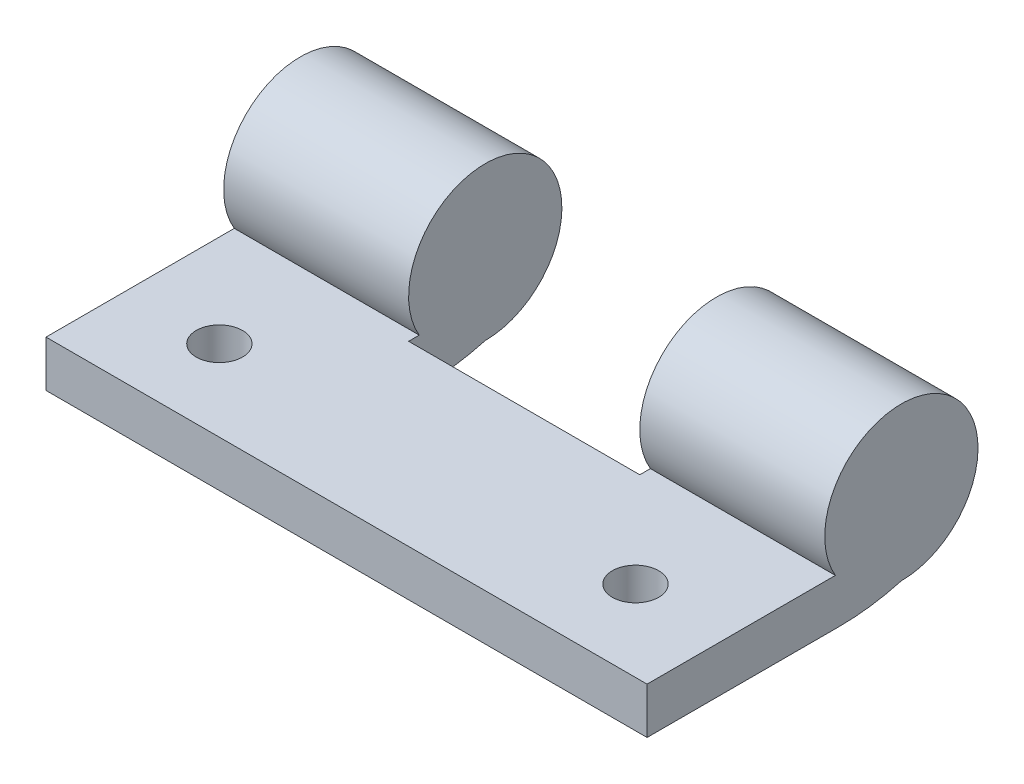
ISO-10303-21;
HEADER;
FILE_DESCRIPTION(('STEP AP214'),'2;1');
FILE_NAME('part.step','',(''),(''),'','','');
FILE_SCHEMA(('AUTOMOTIVE_DESIGN { 1 0 10303 214 1 1 1 1 }'));
ENDSEC;
DATA;
#1=APPLICATION_CONTEXT('core data for automotive mechanical design processes');
#2=APPLICATION_PROTOCOL_DEFINITION('international standard','automotive_design',2000,#1);
#3=PRODUCT_CONTEXT('',#1,'mechanical');
#4=PRODUCT('Part','Part','',(#3));
#5=PRODUCT_RELATED_PRODUCT_CATEGORY('part','',(#4));
#6=PRODUCT_DEFINITION_FORMATION('','',#4);
#7=PRODUCT_DEFINITION_CONTEXT('part definition',#1,'design');
#8=PRODUCT_DEFINITION('design','',#6,#7);
#9=PRODUCT_DEFINITION_SHAPE('','',#8);
#10=(LENGTH_UNIT() NAMED_UNIT(*) SI_UNIT(.MILLI.,.METRE.));
#11=(NAMED_UNIT(*) PLANE_ANGLE_UNIT() SI_UNIT($,.RADIAN.));
#12=(NAMED_UNIT(*) SI_UNIT($,.STERADIAN.) SOLID_ANGLE_UNIT());
#13=UNCERTAINTY_MEASURE_WITH_UNIT(LENGTH_MEASURE(1.E-05),#10,'distance_accuracy_value','');
#14=(GEOMETRIC_REPRESENTATION_CONTEXT(3) GLOBAL_UNCERTAINTY_ASSIGNED_CONTEXT((#13)) GLOBAL_UNIT_ASSIGNED_CONTEXT((#10,
#11,#12)) REPRESENTATION_CONTEXT('',''));
#15=CARTESIAN_POINT('',(0.,0.,0.));
#16=DIRECTION('',(0.,0.,1.));
#17=DIRECTION('',(1.,0.,0.));
#18=AXIS2_PLACEMENT_3D('',#15,#16,#17);
#19=CARTESIAN_POINT('',(-22.3762359185336,3.685,0.));
#20=DIRECTION('',(1.,0.,0.));
#21=DIRECTION('',(0.,0.,-1.));
#22=AXIS2_PLACEMENT_3D('',#19,#20,#21);
#23=CYLINDRICAL_SURFACE('',#22,3.315);
#24=CARTESIAN_POINT('',(-5.,3.685,0.));
#25=DIRECTION('',(-1.,0.,0.));
#26=DIRECTION('',(0.,0.,1.));
#27=AXIS2_PLACEMENT_3D('',#24,#25,#26);
#28=CIRCLE('',#27,3.315);
#29=CARTESIAN_POINT('',(-5.,0.370000000000001,0.));
#30=VERTEX_POINT('',#29);
#31=CARTESIAN_POINT('',(-5.,2.,2.85482048472404));
#32=VERTEX_POINT('',#31);
#33=EDGE_CURVE('E140',#30,#32,#28,.F.);
#34=ORIENTED_EDGE('',*,*,#33,.F.);
#35=DIRECTION('',(1.,0.,0.));
#36=VECTOR('',#35,1.);
#37=CARTESIAN_POINT('',(-22.3762359185336,0.370000000000001,0.));
#38=LINE('',#37,#36);
#39=CARTESIAN_POINT('',(-13.,0.370000000000001,0.));
#40=VERTEX_POINT('',#39);
#41=EDGE_CURVE('E157',#40,#30,#38,.T.);
#42=ORIENTED_EDGE('',*,*,#41,.F.);
#43=CARTESIAN_POINT('',(-13.,3.685,0.));
#44=DIRECTION('',(1.,0.,0.));
#45=DIRECTION('',(0.,0.,-1.));
#46=AXIS2_PLACEMENT_3D('',#43,#44,#45);
#47=CIRCLE('',#46,3.315);
#48=CARTESIAN_POINT('',(-13.,2.,2.85482048472404));
#49=VERTEX_POINT('',#48);
#50=EDGE_CURVE('E153',#49,#40,#47,.F.);
#51=ORIENTED_EDGE('',*,*,#50,.F.);
#52=DIRECTION('',(1.,0.,0.));
#53=VECTOR('',#52,1.);
#54=CARTESIAN_POINT('',(-22.3762359185336,2.,2.85482048472404));
#55=LINE('',#54,#53);
#56=EDGE_CURVE('E161',#49,#32,#55,.T.);
#57=ORIENTED_EDGE('',*,*,#56,.T.);
#58=EDGE_LOOP('',(#34,#42,#51,#57));
#59=FACE_BOUND('',#58,.T.);
#60=ADVANCED_FACE('F38',(#59),#23,.T.);
#61=CARTESIAN_POINT('',(-22.3762359185336,10.,2.69501391462086));
#62=DIRECTION('',(1.,0.,0.));
#63=DIRECTION('',(0.,0.,-1.));
#64=AXIS2_PLACEMENT_3D('',#61,#62,#63);
#65=CYLINDRICAL_SURFACE('',#64,10.);
#66=CARTESIAN_POINT('',(5.,10.,2.69501391462086));
#67=DIRECTION('',(1.,0.,0.));
#68=DIRECTION('',(0.,0.,-1.));
#69=AXIS2_PLACEMENT_3D('',#66,#67,#68);
#70=CIRCLE('',#69,10.);
#71=CARTESIAN_POINT('',(5.,0.370000000000001,0.));
#72=VERTEX_POINT('',#71);
#73=CARTESIAN_POINT('',(5.,0.,2.69501391462085));
#74=VERTEX_POINT('',#73);
#75=EDGE_CURVE('E11',#72,#74,#70,.F.);
#76=ORIENTED_EDGE('',*,*,#75,.F.);
#77=CARTESIAN_POINT('',(13.,0.370000000000001,0.));
#78=VERTEX_POINT('',#77);
#79=EDGE_CURVE('E156',#72,#78,#38,.T.);
#80=ORIENTED_EDGE('',*,*,#79,.T.);
#81=CARTESIAN_POINT('',(13.,10.,2.69501391462086));
#82=DIRECTION('',(-1.,0.,0.));
#83=DIRECTION('',(0.,0.,1.));
#84=AXIS2_PLACEMENT_3D('',#81,#82,#83);
#85=CIRCLE('',#84,10.);
#86=CARTESIAN_POINT('',(13.,0.,2.69501391462086));
#87=VERTEX_POINT('',#86);
#88=EDGE_CURVE('E198',#87,#78,#85,.F.);
#89=ORIENTED_EDGE('',*,*,#88,.F.);
#90=DIRECTION('',(1.,0.,0.));
#91=VECTOR('',#90,1.);
#92=CARTESIAN_POINT('',(0.,0.,2.69501391462086));
#93=LINE('',#92,#91);
#94=EDGE_CURVE('E61',#74,#87,#93,.T.);
#95=ORIENTED_EDGE('',*,*,#94,.F.);
#96=EDGE_LOOP('',(#76,#80,#89,#95));
#97=FACE_BOUND('',#96,.T.);
#98=ADVANCED_FACE('F231',(#97),#65,.T.);
#99=CARTESIAN_POINT('',(0.,2.,0.));
#100=DIRECTION('',(0.,1.,0.));
#101=DIRECTION('',(0.,0.,1.));
#102=AXIS2_PLACEMENT_3D('',#99,#100,#101);
#103=PLANE('',#102);
#104=DIRECTION('',(0.,0.,-1.));
#105=VECTOR('',#104,1.);
#106=CARTESIAN_POINT('',(5.,2.,0.));
#107=LINE('',#106,#105);
#108=CARTESIAN_POINT('',(5.,2.,3.315));
#109=VERTEX_POINT('',#108);
#110=CARTESIAN_POINT('',(5.,2.,2.85482048472404));
#111=VERTEX_POINT('',#110);
#112=EDGE_CURVE('E146',#109,#111,#107,.T.);
#113=ORIENTED_EDGE('',*,*,#112,.F.);
#114=DIRECTION('',(1.,0.,0.));
#115=VECTOR('',#114,1.);
#116=CARTESIAN_POINT('',(0.,2.,3.315));
#117=LINE('',#116,#115);
#118=CARTESIAN_POINT('',(-5.,2.,3.315));
#119=VERTEX_POINT('',#118);
#120=EDGE_CURVE('E148',#119,#109,#117,.T.);
#121=ORIENTED_EDGE('',*,*,#120,.F.);
#122=DIRECTION('',(0.,0.,1.));
#123=VECTOR('',#122,1.);
#124=CARTESIAN_POINT('',(-5.,2.,0.));
#125=LINE('',#124,#123);
#126=EDGE_CURVE('E119',#32,#119,#125,.T.);
#127=ORIENTED_EDGE('',*,*,#126,.F.);
#128=ORIENTED_EDGE('',*,*,#56,.F.);
#129=DIRECTION('',(0.,0.,1.));
#130=VECTOR('',#129,1.);
#131=CARTESIAN_POINT('',(-13.,2.,11.));
#132=LINE('',#131,#130);
#133=CARTESIAN_POINT('',(-13.,2.,11.));
#134=VERTEX_POINT('',#133);
#135=EDGE_CURVE('E180',#49,#134,#132,.T.);
#136=ORIENTED_EDGE('',*,*,#135,.T.);
#137=DIRECTION('',(1.,0.,0.));
#138=VECTOR('',#137,1.);
#139=CARTESIAN_POINT('',(-13.,2.,11.));
#140=LINE('',#139,#138);
#141=CARTESIAN_POINT('',(13.,2.,11.));
#142=VERTEX_POINT('',#141);
#143=EDGE_CURVE('E183',#134,#142,#140,.T.);
#144=ORIENTED_EDGE('',*,*,#143,.T.);
#145=DIRECTION('',(0.,0.,-1.));
#146=VECTOR('',#145,1.);
#147=CARTESIAN_POINT('',(13.,2.,11.));
#148=LINE('',#147,#146);
#149=CARTESIAN_POINT('',(13.,2.,2.85482048472404));
#150=VERTEX_POINT('',#149);
#151=EDGE_CURVE('E177',#142,#150,#148,.T.);
#152=ORIENTED_EDGE('',*,*,#151,.T.);
#153=EDGE_CURVE('E160',#111,#150,#55,.T.);
#154=ORIENTED_EDGE('',*,*,#153,.F.);
#155=EDGE_LOOP('',(#113,#121,#127,#128,#136,#144,#152,#154));
#156=FACE_BOUND('',#155,.T.);
#157=CARTESIAN_POINT('',(9.,2.,7.5));
#158=DIRECTION('',(0.,1.,0.));
#159=DIRECTION('',(0.,0.,1.));
#160=AXIS2_PLACEMENT_3D('',#157,#158,#159);
#161=CIRCLE('',#160,1.);
#162=CARTESIAN_POINT('',(9.,2.,8.5));
#163=VERTEX_POINT('',#162);
#164=EDGE_CURVE('E171',#163,#163,#161,.T.);
#165=ORIENTED_EDGE('',*,*,#164,.F.);
#166=EDGE_LOOP('',(#165));
#167=FACE_BOUND('',#166,.T.);
#168=CARTESIAN_POINT('',(-9.,2.,7.5));
#169=DIRECTION('',(0.,1.,0.));
#170=DIRECTION('',(0.,0.,-1.));
#171=AXIS2_PLACEMENT_3D('',#168,#169,#170);
#172=CIRCLE('',#171,1.);
#173=CARTESIAN_POINT('',(-9.,2.,6.5));
#174=VERTEX_POINT('',#173);
#175=EDGE_CURVE('E165',#174,#174,#172,.T.);
#176=ORIENTED_EDGE('',*,*,#175,.F.);
#177=EDGE_LOOP('',(#176));
#178=FACE_BOUND('',#177,.T.);
#179=ADVANCED_FACE('F207',(#156,#167,#178),#103,.T.);
#180=CARTESIAN_POINT('',(0.,0.,0.));
#181=DIRECTION('',(0.,1.,0.));
#182=DIRECTION('',(0.,0.,1.));
#183=AXIS2_PLACEMENT_3D('',#180,#181,#182);
#184=PLANE('',#183);
#185=DIRECTION('',(1.,0.,0.));
#186=VECTOR('',#185,1.);
#187=CARTESIAN_POINT('',(5.,0.,3.315));
#188=LINE('',#187,#186);
#189=CARTESIAN_POINT('',(-5.,0.,3.315));
#190=VERTEX_POINT('',#189);
#191=CARTESIAN_POINT('',(5.,0.,3.315));
#192=VERTEX_POINT('',#191);
#193=EDGE_CURVE('E123',#190,#192,#188,.T.);
#194=ORIENTED_EDGE('',*,*,#193,.T.);
#195=DIRECTION('',(0.,0.,-1.));
#196=VECTOR('',#195,1.);
#197=CARTESIAN_POINT('',(5.,0.,-3.685));
#198=LINE('',#197,#196);
#199=EDGE_CURVE('E136',#192,#74,#198,.T.);
#200=ORIENTED_EDGE('',*,*,#199,.T.);
#201=ORIENTED_EDGE('',*,*,#94,.T.);
#202=DIRECTION('',(0.,0.,-1.));
#203=VECTOR('',#202,1.);
#204=CARTESIAN_POINT('',(13.,0.,11.));
#205=LINE('',#204,#203);
#206=CARTESIAN_POINT('',(13.,0.,11.));
#207=VERTEX_POINT('',#206);
#208=EDGE_CURVE('E174',#207,#87,#205,.T.);
#209=ORIENTED_EDGE('',*,*,#208,.F.);
#210=DIRECTION('',(1.,0.,0.));
#211=VECTOR('',#210,1.);
#212=CARTESIAN_POINT('',(-13.,0.,11.));
#213=LINE('',#212,#211);
#214=CARTESIAN_POINT('',(-13.,0.,11.));
#215=VERTEX_POINT('',#214);
#216=EDGE_CURVE('E181',#215,#207,#213,.T.);
#217=ORIENTED_EDGE('',*,*,#216,.F.);
#218=DIRECTION('',(0.,0.,1.));
#219=VECTOR('',#218,1.);
#220=CARTESIAN_POINT('',(-13.,0.,11.));
#221=LINE('',#220,#219);
#222=CARTESIAN_POINT('',(-13.,0.,2.69501391462086));
#223=VERTEX_POINT('',#222);
#224=EDGE_CURVE('E187',#223,#215,#221,.T.);
#225=ORIENTED_EDGE('',*,*,#224,.F.);
#226=CARTESIAN_POINT('',(-5.,0.,2.69501391462086));
#227=VERTEX_POINT('',#226);
#228=EDGE_CURVE('E135',#223,#227,#93,.T.);
#229=ORIENTED_EDGE('',*,*,#228,.T.);
#230=DIRECTION('',(0.,0.,1.));
#231=VECTOR('',#230,1.);
#232=CARTESIAN_POINT('',(-5.,0.,-3.685));
#233=LINE('',#232,#231);
#234=EDGE_CURVE('E53',#227,#190,#233,.T.);
#235=ORIENTED_EDGE('',*,*,#234,.T.);
#236=EDGE_LOOP('',(#194,#200,#201,#209,#217,#225,#229,#235));
#237=FACE_BOUND('',#236,.T.);
#238=CARTESIAN_POINT('',(9.,0.,7.5));
#239=DIRECTION('',(0.,1.,0.));
#240=DIRECTION('',(0.,0.,1.));
#241=AXIS2_PLACEMENT_3D('',#238,#239,#240);
#242=CIRCLE('',#241,1.);
#243=CARTESIAN_POINT('',(9.,0.,8.5));
#244=VERTEX_POINT('',#243);
#245=EDGE_CURVE('E168',#244,#244,#242,.T.);
#246=ORIENTED_EDGE('',*,*,#245,.T.);
#247=EDGE_LOOP('',(#246));
#248=FACE_BOUND('',#247,.T.);
#249=CARTESIAN_POINT('',(-9.,0.,7.5));
#250=DIRECTION('',(0.,1.,0.));
#251=DIRECTION('',(0.,0.,-1.));
#252=AXIS2_PLACEMENT_3D('',#249,#250,#251);
#253=CIRCLE('',#252,1.);
#254=CARTESIAN_POINT('',(-9.,0.,6.5));
#255=VERTEX_POINT('',#254);
#256=EDGE_CURVE('E164',#255,#255,#253,.T.);
#257=ORIENTED_EDGE('',*,*,#256,.T.);
#258=EDGE_LOOP('',(#257));
#259=FACE_BOUND('',#258,.T.);
#260=ADVANCED_FACE('F131',(#237,#248,#259),#184,.F.);
#261=CARTESIAN_POINT('',(13.,2.,11.));
#262=DIRECTION('',(-1.,0.,0.));
#263=DIRECTION('',(0.,0.,1.));
#264=AXIS2_PLACEMENT_3D('',#261,#262,#263);
#265=PLANE('',#264);
#266=ORIENTED_EDGE('',*,*,#208,.T.);
#267=ORIENTED_EDGE('',*,*,#88,.T.);
#268=CARTESIAN_POINT('',(13.,3.685,0.));
#269=DIRECTION('',(1.,0.,0.));
#270=DIRECTION('',(0.,0.,-1.));
#271=AXIS2_PLACEMENT_3D('',#268,#269,#270);
#272=CIRCLE('',#271,3.315);
#273=EDGE_CURVE('E150',#78,#150,#272,.T.);
#274=ORIENTED_EDGE('',*,*,#273,.T.);
#275=ORIENTED_EDGE('',*,*,#151,.F.);
#276=DIRECTION('',(0.,-1.,0.));
#277=VECTOR('',#276,1.);
#278=CARTESIAN_POINT('',(13.,2.,11.));
#279=LINE('',#278,#277);
#280=EDGE_CURVE('E185',#142,#207,#279,.T.);
#281=ORIENTED_EDGE('',*,*,#280,.T.);
#282=EDGE_LOOP('',(#266,#267,#274,#275,#281));
#283=FACE_BOUND('',#282,.T.);
#284=ADVANCED_FACE('F220',(#283),#265,.F.);
#285=CARTESIAN_POINT('',(-13.,2.,11.));
#286=DIRECTION('',(1.,0.,0.));
#287=DIRECTION('',(0.,0.,-1.));
#288=AXIS2_PLACEMENT_3D('',#285,#286,#287);
#289=PLANE('',#288);
#290=ORIENTED_EDGE('',*,*,#50,.T.);
#291=CARTESIAN_POINT('',(-13.,10.,2.69501391462086));
#292=DIRECTION('',(1.,0.,0.));
#293=DIRECTION('',(0.,0.,-1.));
#294=AXIS2_PLACEMENT_3D('',#291,#292,#293);
#295=CIRCLE('',#294,10.);
#296=EDGE_CURVE('E195',#40,#223,#295,.F.);
#297=ORIENTED_EDGE('',*,*,#296,.T.);
#298=ORIENTED_EDGE('',*,*,#224,.T.);
#299=DIRECTION('',(0.,-1.,0.));
#300=VECTOR('',#299,1.);
#301=CARTESIAN_POINT('',(-13.,2.,11.));
#302=LINE('',#301,#300);
#303=EDGE_CURVE('E192',#134,#215,#302,.T.);
#304=ORIENTED_EDGE('',*,*,#303,.F.);
#305=ORIENTED_EDGE('',*,*,#135,.F.);
#306=EDGE_LOOP('',(#290,#297,#298,#304,#305));
#307=FACE_BOUND('',#306,.T.);
#308=ADVANCED_FACE('F211',(#307),#289,.F.);
#309=CARTESIAN_POINT('',(-13.,2.,11.));
#310=DIRECTION('',(0.,0.,-1.));
#311=DIRECTION('',(-1.,0.,0.));
#312=AXIS2_PLACEMENT_3D('',#309,#310,#311);
#313=PLANE('',#312);
#314=ORIENTED_EDGE('',*,*,#216,.T.);
#315=ORIENTED_EDGE('',*,*,#280,.F.);
#316=ORIENTED_EDGE('',*,*,#143,.F.);
#317=ORIENTED_EDGE('',*,*,#303,.T.);
#318=EDGE_LOOP('',(#314,#315,#316,#317));
#319=FACE_BOUND('',#318,.T.);
#320=ADVANCED_FACE('F216',(#319),#313,.F.);
#321=CARTESIAN_POINT('',(9.,2.,7.5));
#322=DIRECTION('',(0.,-1.,0.));
#323=DIRECTION('',(0.,0.,-1.));
#324=AXIS2_PLACEMENT_3D('',#321,#322,#323);
#325=CYLINDRICAL_SURFACE('',#324,1.);
#326=ORIENTED_EDGE('',*,*,#164,.T.);
#327=EDGE_LOOP('',(#326));
#328=FACE_BOUND('',#327,.T.);
#329=ORIENTED_EDGE('',*,*,#245,.F.);
#330=EDGE_LOOP('',(#329));
#331=FACE_BOUND('',#330,.T.);
#332=ADVANCED_FACE('F249',(#328,#331),#325,.F.);
#333=CARTESIAN_POINT('',(-9.,2.,7.5));
#334=DIRECTION('',(0.,-1.,0.));
#335=DIRECTION('',(0.,0.,-1.));
#336=AXIS2_PLACEMENT_3D('',#333,#334,#335);
#337=CYLINDRICAL_SURFACE('',#336,1.);
#338=ORIENTED_EDGE('',*,*,#175,.T.);
#339=EDGE_LOOP('',(#338));
#340=FACE_BOUND('',#339,.T.);
#341=ORIENTED_EDGE('',*,*,#256,.F.);
#342=EDGE_LOOP('',(#341));
#343=FACE_BOUND('',#342,.T.);
#344=ADVANCED_FACE('F245',(#340,#343),#337,.F.);
#345=ORIENTED_EDGE('',*,*,#79,.F.);
#346=CARTESIAN_POINT('',(5.,3.685,0.));
#347=DIRECTION('',(1.,0.,0.));
#348=DIRECTION('',(0.,0.,-1.));
#349=AXIS2_PLACEMENT_3D('',#346,#347,#348);
#350=CIRCLE('',#349,3.315);
#351=EDGE_CURVE('E144',#111,#72,#350,.F.);
#352=ORIENTED_EDGE('',*,*,#351,.F.);
#353=ORIENTED_EDGE('',*,*,#153,.T.);
#354=ORIENTED_EDGE('',*,*,#273,.F.);
#355=EDGE_LOOP('',(#345,#352,#353,#354));
#356=FACE_BOUND('',#355,.T.);
#357=ADVANCED_FACE('F225',(#356),#23,.T.);
#358=CARTESIAN_POINT('',(-5.,10.,2.69501391462086));
#359=DIRECTION('',(-1.,0.,0.));
#360=DIRECTION('',(0.,0.,1.));
#361=AXIS2_PLACEMENT_3D('',#358,#359,#360);
#362=CIRCLE('',#361,10.);
#363=EDGE_CURVE('E46',#227,#30,#362,.F.);
#364=ORIENTED_EDGE('',*,*,#363,.F.);
#365=ORIENTED_EDGE('',*,*,#228,.F.);
#366=ORIENTED_EDGE('',*,*,#296,.F.);
#367=ORIENTED_EDGE('',*,*,#41,.T.);
#368=EDGE_LOOP('',(#364,#365,#366,#367));
#369=FACE_BOUND('',#368,.T.);
#370=ADVANCED_FACE('F40',(#369),#65,.T.);
#371=CARTESIAN_POINT('',(5.,0.,3.315));
#372=DIRECTION('',(0.,0.,1.));
#373=DIRECTION('',(1.,0.,0.));
#374=AXIS2_PLACEMENT_3D('',#371,#372,#373);
#375=PLANE('',#374);
#376=ORIENTED_EDGE('',*,*,#120,.T.);
#377=DIRECTION('',(0.,1.,0.));
#378=VECTOR('',#377,1.);
#379=CARTESIAN_POINT('',(5.,0.,3.315));
#380=LINE('',#379,#378);
#381=EDGE_CURVE('E122',#192,#109,#380,.T.);
#382=ORIENTED_EDGE('',*,*,#381,.F.);
#383=ORIENTED_EDGE('',*,*,#193,.F.);
#384=DIRECTION('',(0.,1.,0.));
#385=VECTOR('',#384,1.);
#386=CARTESIAN_POINT('',(-5.,0.,3.315));
#387=LINE('',#386,#385);
#388=EDGE_CURVE('E115',#190,#119,#387,.T.);
#389=ORIENTED_EDGE('',*,*,#388,.T.);
#390=EDGE_LOOP('',(#376,#382,#383,#389));
#391=FACE_BOUND('',#390,.T.);
#392=ADVANCED_FACE('F126',(#391),#375,.F.);
#393=CARTESIAN_POINT('',(5.,0.,-3.685));
#394=DIRECTION('',(1.,0.,0.));
#395=DIRECTION('',(0.,0.,-1.));
#396=AXIS2_PLACEMENT_3D('',#393,#394,#395);
#397=PLANE('',#396);
#398=ORIENTED_EDGE('',*,*,#112,.T.);
#399=ORIENTED_EDGE('',*,*,#351,.T.);
#400=ORIENTED_EDGE('',*,*,#75,.T.);
#401=ORIENTED_EDGE('',*,*,#199,.F.);
#402=ORIENTED_EDGE('',*,*,#381,.T.);
#403=EDGE_LOOP('',(#398,#399,#400,#401,#402));
#404=FACE_BOUND('',#403,.T.);
#405=ADVANCED_FACE('F229',(#404),#397,.F.);
#406=CARTESIAN_POINT('',(-5.,0.,-3.685));
#407=DIRECTION('',(-1.,0.,0.));
#408=DIRECTION('',(0.,0.,1.));
#409=AXIS2_PLACEMENT_3D('',#406,#407,#408);
#410=PLANE('',#409);
#411=ORIENTED_EDGE('',*,*,#126,.T.);
#412=ORIENTED_EDGE('',*,*,#388,.F.);
#413=ORIENTED_EDGE('',*,*,#234,.F.);
#414=ORIENTED_EDGE('',*,*,#363,.T.);
#415=ORIENTED_EDGE('',*,*,#33,.T.);
#416=EDGE_LOOP('',(#411,#412,#413,#414,#415));
#417=FACE_BOUND('',#416,.T.);
#418=ADVANCED_FACE('F117',(#417),#410,.F.);
#419=CLOSED_SHELL('',(#60,#98,#179,#260,#284,#308,#320,#332,#344,#357,#370,#392,#405,#418));
#420=MANIFOLD_SOLID_BREP('B2',#419);
#421=ADVANCED_BREP_SHAPE_REPRESENTATION('',(#18,#420),#14);
#422=SHAPE_DEFINITION_REPRESENTATION(#9,#421);
ENDSEC;
END-ISO-10303-21;
